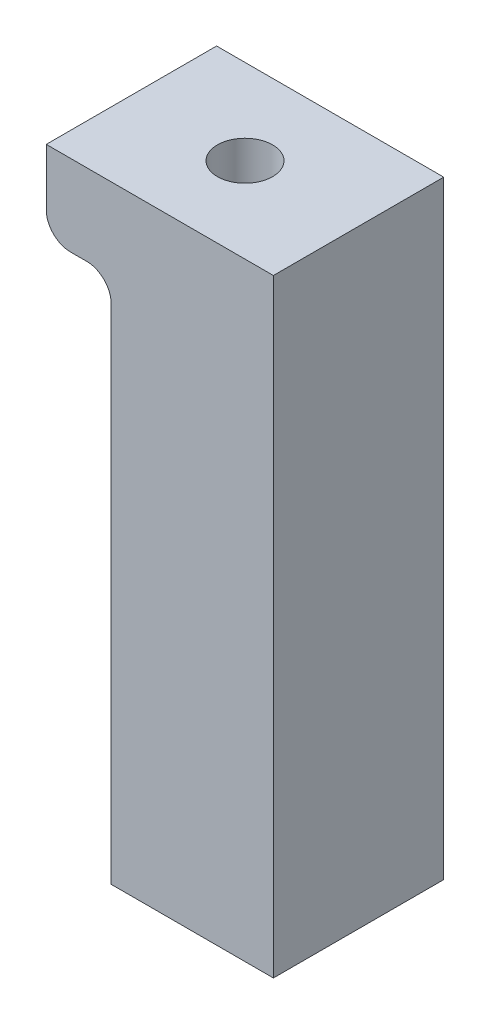
ISO-10303-21;
HEADER;
FILE_DESCRIPTION(('STEP AP214'),'2;1');
FILE_NAME('part.step','',(''),(''),'','','');
FILE_SCHEMA(('AUTOMOTIVE_DESIGN { 1 0 10303 214 1 1 1 1 }'));
ENDSEC;
DATA;
#1=APPLICATION_CONTEXT('core data for automotive mechanical design processes');
#2=APPLICATION_PROTOCOL_DEFINITION('international standard','automotive_design',2000,#1);
#3=PRODUCT_CONTEXT('',#1,'mechanical');
#4=PRODUCT('Part','Part','',(#3));
#5=PRODUCT_RELATED_PRODUCT_CATEGORY('part','',(#4));
#6=PRODUCT_DEFINITION_FORMATION('','',#4);
#7=PRODUCT_DEFINITION_CONTEXT('part definition',#1,'design');
#8=PRODUCT_DEFINITION('design','',#6,#7);
#9=PRODUCT_DEFINITION_SHAPE('','',#8);
#10=(LENGTH_UNIT() NAMED_UNIT(*) SI_UNIT(.MILLI.,.METRE.));
#11=(NAMED_UNIT(*) PLANE_ANGLE_UNIT() SI_UNIT($,.RADIAN.));
#12=(NAMED_UNIT(*) SI_UNIT($,.STERADIAN.) SOLID_ANGLE_UNIT());
#13=UNCERTAINTY_MEASURE_WITH_UNIT(LENGTH_MEASURE(1.E-05),#10,'distance_accuracy_value','');
#14=(GEOMETRIC_REPRESENTATION_CONTEXT(3) GLOBAL_UNCERTAINTY_ASSIGNED_CONTEXT((#13)) GLOBAL_UNIT_ASSIGNED_CONTEXT((#10,
#11,#12)) REPRESENTATION_CONTEXT('',''));
#15=CARTESIAN_POINT('',(0.,0.,0.));
#16=DIRECTION('',(0.,0.,1.));
#17=DIRECTION('',(1.,0.,0.));
#18=AXIS2_PLACEMENT_3D('',#15,#16,#17);
#19=CARTESIAN_POINT('',(14.,110.,-10.5));
#20=DIRECTION('',(-1.,0.,0.));
#21=DIRECTION('',(0.,0.,1.));
#22=AXIS2_PLACEMENT_3D('',#19,#20,#21);
#23=PLANE('',#22);
#24=DIRECTION('',(0.,0.,-1.));
#25=VECTOR('',#24,1.);
#26=CARTESIAN_POINT('',(14.,75.,-10.5));
#27=LINE('',#26,#25);
#28=CARTESIAN_POINT('',(14.,75.,10.5));
#29=VERTEX_POINT('',#28);
#30=CARTESIAN_POINT('',(14.,75.,-10.5));
#31=VERTEX_POINT('',#30);
#32=EDGE_CURVE('E163',#29,#31,#27,.T.);
#33=ORIENTED_EDGE('',*,*,#32,.F.);
#34=DIRECTION('',(0.,-1.,0.));
#35=VECTOR('',#34,1.);
#36=CARTESIAN_POINT('',(14.,110.,10.5));
#37=LINE('',#36,#35);
#38=CARTESIAN_POINT('',(14.,0.,10.5));
#39=VERTEX_POINT('',#38);
#40=EDGE_CURVE('E143',#29,#39,#37,.T.);
#41=ORIENTED_EDGE('',*,*,#40,.T.);
#42=DIRECTION('',(0.,0.,-1.));
#43=VECTOR('',#42,1.);
#44=CARTESIAN_POINT('',(14.,0.,-10.5));
#45=LINE('',#44,#43);
#46=CARTESIAN_POINT('',(14.,0.,-10.5));
#47=VERTEX_POINT('',#46);
#48=EDGE_CURVE('E153',#39,#47,#45,.T.);
#49=ORIENTED_EDGE('',*,*,#48,.T.);
#50=DIRECTION('',(0.,-1.,0.));
#51=VECTOR('',#50,1.);
#52=CARTESIAN_POINT('',(14.,110.,-10.5));
#53=LINE('',#52,#51);
#54=EDGE_CURVE('E152',#31,#47,#53,.T.);
#55=ORIENTED_EDGE('',*,*,#54,.F.);
#56=EDGE_LOOP('',(#33,#41,#49,#55));
#57=FACE_BOUND('',#56,.T.);
#58=ADVANCED_FACE('F39',(#57),#23,.F.);
#59=CARTESIAN_POINT('',(-14.,110.,-10.5));
#60=DIRECTION('',(0.,0.,1.));
#61=DIRECTION('',(1.,0.,0.));
#62=AXIS2_PLACEMENT_3D('',#59,#60,#61);
#63=PLANE('',#62);
#64=DIRECTION('',(-1.,0.,0.));
#65=VECTOR('',#64,1.);
#66=CARTESIAN_POINT('',(-14.,65.,-10.5));
#67=LINE('',#66,#65);
#68=CARTESIAN_POINT('',(-9.,65.,-10.5));
#69=VERTEX_POINT('',#68);
#70=CARTESIAN_POINT('',(-11.,65.,-10.5));
#71=VERTEX_POINT('',#70);
#72=EDGE_CURVE('E131',#69,#71,#67,.T.);
#73=ORIENTED_EDGE('',*,*,#72,.T.);
#74=CARTESIAN_POINT('',(-11.,68.,-10.5));
#75=DIRECTION('',(0.,0.,1.));
#76=DIRECTION('',(1.,0.,0.));
#77=AXIS2_PLACEMENT_3D('',#74,#75,#76);
#78=CIRCLE('',#77,3.);
#79=CARTESIAN_POINT('',(-14.,68.,-10.5));
#80=VERTEX_POINT('',#79);
#81=EDGE_CURVE('E62',#71,#80,#78,.F.);
#82=ORIENTED_EDGE('',*,*,#81,.T.);
#83=DIRECTION('',(0.,-1.,0.));
#84=VECTOR('',#83,1.);
#85=CARTESIAN_POINT('',(-14.,110.,-10.5));
#86=LINE('',#85,#84);
#87=CARTESIAN_POINT('',(-14.,75.,-10.5));
#88=VERTEX_POINT('',#87);
#89=EDGE_CURVE('E151',#88,#80,#86,.T.);
#90=ORIENTED_EDGE('',*,*,#89,.F.);
#91=DIRECTION('',(-1.,0.,0.));
#92=VECTOR('',#91,1.);
#93=CARTESIAN_POINT('',(-14.,75.,-10.5));
#94=LINE('',#93,#92);
#95=EDGE_CURVE('E160',#31,#88,#94,.T.);
#96=ORIENTED_EDGE('',*,*,#95,.F.);
#97=ORIENTED_EDGE('',*,*,#54,.T.);
#98=DIRECTION('',(-1.,0.,0.));
#99=VECTOR('',#98,1.);
#100=CARTESIAN_POINT('',(-14.,0.,-10.5));
#101=LINE('',#100,#99);
#102=CARTESIAN_POINT('',(-6.,0.,-10.5));
#103=VERTEX_POINT('',#102);
#104=EDGE_CURVE('E148',#47,#103,#101,.T.);
#105=ORIENTED_EDGE('',*,*,#104,.T.);
#106=DIRECTION('',(0.,1.,0.));
#107=VECTOR('',#106,1.);
#108=CARTESIAN_POINT('',(-6.,0.,-10.5));
#109=LINE('',#108,#107);
#110=CARTESIAN_POINT('',(-6.,62.,-10.5));
#111=VERTEX_POINT('',#110);
#112=EDGE_CURVE('E128',#103,#111,#109,.T.);
#113=ORIENTED_EDGE('',*,*,#112,.T.);
#114=CARTESIAN_POINT('',(-9.,62.,-10.5));
#115=DIRECTION('',(0.,0.,1.));
#116=DIRECTION('',(1.,0.,0.));
#117=AXIS2_PLACEMENT_3D('',#114,#115,#116);
#118=CIRCLE('',#117,3.);
#119=EDGE_CURVE('E11',#111,#69,#118,.T.);
#120=ORIENTED_EDGE('',*,*,#119,.T.);
#121=EDGE_LOOP('',(#73,#82,#90,#96,#97,#105,#113,#120));
#122=FACE_BOUND('',#121,.T.);
#123=ADVANCED_FACE('F197',(#122),#63,.F.);
#124=CARTESIAN_POINT('',(-14.,110.,-10.5));
#125=DIRECTION('',(1.,0.,0.));
#126=DIRECTION('',(0.,0.,-1.));
#127=AXIS2_PLACEMENT_3D('',#124,#125,#126);
#128=PLANE('',#127);
#129=ORIENTED_EDGE('',*,*,#89,.T.);
#130=DIRECTION('',(0.,0.,1.));
#131=VECTOR('',#130,1.);
#132=CARTESIAN_POINT('',(-14.,68.,-10.5));
#133=LINE('',#132,#131);
#134=CARTESIAN_POINT('',(-14.,68.,10.5));
#135=VERTEX_POINT('',#134);
#136=EDGE_CURVE('E180',#80,#135,#133,.T.);
#137=ORIENTED_EDGE('',*,*,#136,.T.);
#138=DIRECTION('',(0.,-1.,0.));
#139=VECTOR('',#138,1.);
#140=CARTESIAN_POINT('',(-14.,110.,10.5));
#141=LINE('',#140,#139);
#142=CARTESIAN_POINT('',(-14.,75.,10.5));
#143=VERTEX_POINT('',#142);
#144=EDGE_CURVE('E147',#143,#135,#141,.T.);
#145=ORIENTED_EDGE('',*,*,#144,.F.);
#146=DIRECTION('',(0.,0.,1.));
#147=VECTOR('',#146,1.);
#148=CARTESIAN_POINT('',(-14.,75.,-10.5));
#149=LINE('',#148,#147);
#150=EDGE_CURVE('E156',#88,#143,#149,.T.);
#151=ORIENTED_EDGE('',*,*,#150,.F.);
#152=EDGE_LOOP('',(#129,#137,#145,#151));
#153=FACE_BOUND('',#152,.T.);
#154=ADVANCED_FACE('F201',(#153),#128,.F.);
#155=CARTESIAN_POINT('',(-14.,110.,10.5));
#156=DIRECTION('',(0.,0.,-1.));
#157=DIRECTION('',(-1.,0.,0.));
#158=AXIS2_PLACEMENT_3D('',#155,#156,#157);
#159=PLANE('',#158);
#160=ORIENTED_EDGE('',*,*,#144,.T.);
#161=CARTESIAN_POINT('',(-11.,68.,10.5));
#162=DIRECTION('',(0.,0.,-1.));
#163=DIRECTION('',(-1.,0.,0.));
#164=AXIS2_PLACEMENT_3D('',#161,#162,#163);
#165=CIRCLE('',#164,3.);
#166=CARTESIAN_POINT('',(-11.,65.,10.5));
#167=VERTEX_POINT('',#166);
#168=EDGE_CURVE('E54',#135,#167,#165,.F.);
#169=ORIENTED_EDGE('',*,*,#168,.T.);
#170=DIRECTION('',(-1.,0.,0.));
#171=VECTOR('',#170,1.);
#172=CARTESIAN_POINT('',(-14.,65.,10.5));
#173=LINE('',#172,#171);
#174=CARTESIAN_POINT('',(-9.,65.,10.5));
#175=VERTEX_POINT('',#174);
#176=EDGE_CURVE('E123',#175,#167,#173,.T.);
#177=ORIENTED_EDGE('',*,*,#176,.F.);
#178=CARTESIAN_POINT('',(-9.,62.,10.5));
#179=DIRECTION('',(0.,0.,-1.));
#180=DIRECTION('',(-1.,0.,0.));
#181=AXIS2_PLACEMENT_3D('',#178,#179,#180);
#182=CIRCLE('',#181,3.);
#183=CARTESIAN_POINT('',(-6.,62.,10.5));
#184=VERTEX_POINT('',#183);
#185=EDGE_CURVE('E47',#175,#184,#182,.T.);
#186=ORIENTED_EDGE('',*,*,#185,.T.);
#187=DIRECTION('',(0.,1.,0.));
#188=VECTOR('',#187,1.);
#189=CARTESIAN_POINT('',(-6.,0.,10.5));
#190=LINE('',#189,#188);
#191=CARTESIAN_POINT('',(-6.,0.,10.5));
#192=VERTEX_POINT('',#191);
#193=EDGE_CURVE('E119',#192,#184,#190,.T.);
#194=ORIENTED_EDGE('',*,*,#193,.F.);
#195=DIRECTION('',(1.,0.,0.));
#196=VECTOR('',#195,1.);
#197=CARTESIAN_POINT('',(-14.,0.,10.5));
#198=LINE('',#197,#196);
#199=EDGE_CURVE('E144',#192,#39,#198,.T.);
#200=ORIENTED_EDGE('',*,*,#199,.T.);
#201=ORIENTED_EDGE('',*,*,#40,.F.);
#202=DIRECTION('',(1.,0.,0.));
#203=VECTOR('',#202,1.);
#204=CARTESIAN_POINT('',(-14.,75.,10.5));
#205=LINE('',#204,#203);
#206=EDGE_CURVE('E146',#143,#29,#205,.T.);
#207=ORIENTED_EDGE('',*,*,#206,.F.);
#208=EDGE_LOOP('',(#160,#169,#177,#186,#194,#200,#201,#207));
#209=FACE_BOUND('',#208,.T.);
#210=ADVANCED_FACE('F186',(#209),#159,.F.);
#211=CARTESIAN_POINT('',(0.,0.,0.));
#212=DIRECTION('',(0.,1.,0.));
#213=DIRECTION('',(0.,0.,1.));
#214=AXIS2_PLACEMENT_3D('',#211,#212,#213);
#215=PLANE('',#214);
#216=CARTESIAN_POINT('',(0.,0.,0.));
#217=DIRECTION('',(0.,-1.,0.));
#218=DIRECTION('',(0.,0.,-1.));
#219=AXIS2_PLACEMENT_3D('',#216,#217,#218);
#220=CIRCLE('',#219,2.49999999999999);
#221=CARTESIAN_POINT('',(0.,0.,-2.49999999999999));
#222=VERTEX_POINT('',#221);
#223=EDGE_CURVE('E120',#222,#222,#220,.T.);
#224=ORIENTED_EDGE('',*,*,#223,.F.);
#225=EDGE_LOOP('',(#224));
#226=FACE_BOUND('',#225,.T.);
#227=ORIENTED_EDGE('',*,*,#199,.F.);
#228=DIRECTION('',(0.,0.,1.));
#229=VECTOR('',#228,1.);
#230=CARTESIAN_POINT('',(-6.,0.,-10.5));
#231=LINE('',#230,#229);
#232=EDGE_CURVE('E132',#103,#192,#231,.T.);
#233=ORIENTED_EDGE('',*,*,#232,.F.);
#234=ORIENTED_EDGE('',*,*,#104,.F.);
#235=ORIENTED_EDGE('',*,*,#48,.F.);
#236=EDGE_LOOP('',(#227,#233,#234,#235));
#237=FACE_BOUND('',#236,.T.);
#238=ADVANCED_FACE('F211',(#226,#237),#215,.F.);
#239=CARTESIAN_POINT('',(-14.,75.,-10.5));
#240=DIRECTION('',(0.,1.,0.));
#241=DIRECTION('',(-1.,0.,0.));
#242=AXIS2_PLACEMENT_3D('',#239,#240,#241);
#243=PLANE('',#242);
#244=CARTESIAN_POINT('',(0.,75.,0.));
#245=DIRECTION('',(0.,1.,0.));
#246=DIRECTION('',(0.,0.,1.));
#247=AXIS2_PLACEMENT_3D('',#244,#245,#246);
#248=CIRCLE('',#247,3.39999999999999);
#249=CARTESIAN_POINT('',(0.,75.,3.39999999999999));
#250=VERTEX_POINT('',#249);
#251=EDGE_CURVE('E137',#250,#250,#248,.T.);
#252=ORIENTED_EDGE('',*,*,#251,.F.);
#253=EDGE_LOOP('',(#252));
#254=FACE_BOUND('',#253,.T.);
#255=ORIENTED_EDGE('',*,*,#206,.T.);
#256=ORIENTED_EDGE('',*,*,#32,.T.);
#257=ORIENTED_EDGE('',*,*,#95,.T.);
#258=ORIENTED_EDGE('',*,*,#150,.T.);
#259=EDGE_LOOP('',(#255,#256,#257,#258));
#260=FACE_BOUND('',#259,.T.);
#261=ADVANCED_FACE('F205',(#254,#260),#243,.T.);
#262=CARTESIAN_POINT('',(0.,55.25,0.));
#263=DIRECTION('',(0.,1.,0.));
#264=DIRECTION('',(0.,0.,1.));
#265=AXIS2_PLACEMENT_3D('',#262,#263,#264);
#266=CONICAL_SURFACE('',#265,3.39999999999999,1.02974425867665);
#267=CARTESIAN_POINT('',(0.,53.2070738953063,0.));
#268=VERTEX_POINT('',#267);
#269=VERTEX_LOOP('',#268);
#270=FACE_BOUND('',#269,.T.);
#271=CARTESIAN_POINT('',(0.,55.25,0.));
#272=DIRECTION('',(0.,1.,0.));
#273=DIRECTION('',(0.,0.,1.));
#274=AXIS2_PLACEMENT_3D('',#271,#272,#273);
#275=CIRCLE('',#274,3.39999999999999);
#276=CARTESIAN_POINT('',(0.,55.25,3.39999999999999));
#277=VERTEX_POINT('',#276);
#278=EDGE_CURVE('E140',#277,#277,#275,.T.);
#279=ORIENTED_EDGE('',*,*,#278,.T.);
#280=EDGE_LOOP('',(#279));
#281=FACE_BOUND('',#280,.T.);
#282=ADVANCED_FACE('F219',(#270,#281),#266,.F.);
#283=CARTESIAN_POINT('',(0.,75.,0.));
#284=DIRECTION('',(0.,1.,0.));
#285=DIRECTION('',(0.,0.,1.));
#286=AXIS2_PLACEMENT_3D('',#283,#284,#285);
#287=CYLINDRICAL_SURFACE('',#286,3.39999999999999);
#288=ORIENTED_EDGE('',*,*,#278,.F.);
#289=EDGE_LOOP('',(#288));
#290=FACE_BOUND('',#289,.T.);
#291=ORIENTED_EDGE('',*,*,#251,.T.);
#292=EDGE_LOOP('',(#291));
#293=FACE_BOUND('',#292,.T.);
#294=ADVANCED_FACE('F241',(#290,#293),#287,.F.);
#295=CARTESIAN_POINT('',(-14.,65.,-10.5));
#296=DIRECTION('',(0.,1.,0.));
#297=DIRECTION('',(0.,0.,1.));
#298=AXIS2_PLACEMENT_3D('',#295,#296,#297);
#299=PLANE('',#298);
#300=ORIENTED_EDGE('',*,*,#72,.F.);
#301=DIRECTION('',(0.,0.,1.));
#302=VECTOR('',#301,1.);
#303=CARTESIAN_POINT('',(-9.,65.,10.5));
#304=LINE('',#303,#302);
#305=EDGE_CURVE('E175',#69,#175,#304,.T.);
#306=ORIENTED_EDGE('',*,*,#305,.T.);
#307=ORIENTED_EDGE('',*,*,#176,.T.);
#308=DIRECTION('',(0.,0.,1.));
#309=VECTOR('',#308,1.);
#310=CARTESIAN_POINT('',(-11.,65.,-10.5));
#311=LINE('',#310,#309);
#312=EDGE_CURVE('E159',#167,#71,#311,.F.);
#313=ORIENTED_EDGE('',*,*,#312,.T.);
#314=EDGE_LOOP('',(#300,#306,#307,#313));
#315=FACE_BOUND('',#314,.T.);
#316=ADVANCED_FACE('F199',(#315),#299,.F.);
#317=CARTESIAN_POINT('',(-6.,0.,-10.5));
#318=DIRECTION('',(1.,0.,0.));
#319=DIRECTION('',(0.,0.,-1.));
#320=AXIS2_PLACEMENT_3D('',#317,#318,#319);
#321=PLANE('',#320);
#322=ORIENTED_EDGE('',*,*,#193,.T.);
#323=DIRECTION('',(0.,0.,1.));
#324=VECTOR('',#323,1.);
#325=CARTESIAN_POINT('',(-6.,62.,-10.5));
#326=LINE('',#325,#324);
#327=EDGE_CURVE('E178',#184,#111,#326,.F.);
#328=ORIENTED_EDGE('',*,*,#327,.T.);
#329=ORIENTED_EDGE('',*,*,#112,.F.);
#330=ORIENTED_EDGE('',*,*,#232,.T.);
#331=EDGE_LOOP('',(#322,#328,#329,#330));
#332=FACE_BOUND('',#331,.T.);
#333=ADVANCED_FACE('F192',(#332),#321,.F.);
#334=CARTESIAN_POINT('',(-9.,62.,-10.5));
#335=DIRECTION('',(0.,0.,-1.));
#336=DIRECTION('',(-1.,0.,0.));
#337=AXIS2_PLACEMENT_3D('',#334,#335,#336);
#338=CYLINDRICAL_SURFACE('',#337,3.);
#339=ORIENTED_EDGE('',*,*,#119,.F.);
#340=ORIENTED_EDGE('',*,*,#327,.F.);
#341=ORIENTED_EDGE('',*,*,#185,.F.);
#342=ORIENTED_EDGE('',*,*,#305,.F.);
#343=EDGE_LOOP('',(#339,#340,#341,#342));
#344=FACE_BOUND('',#343,.T.);
#345=ADVANCED_FACE('F195',(#344),#338,.F.);
#346=CARTESIAN_POINT('',(-11.,68.,-10.5));
#347=DIRECTION('',(0.,0.,1.));
#348=DIRECTION('',(1.,0.,0.));
#349=AXIS2_PLACEMENT_3D('',#346,#347,#348);
#350=CYLINDRICAL_SURFACE('',#349,3.);
#351=ORIENTED_EDGE('',*,*,#81,.F.);
#352=ORIENTED_EDGE('',*,*,#312,.F.);
#353=ORIENTED_EDGE('',*,*,#168,.F.);
#354=ORIENTED_EDGE('',*,*,#136,.F.);
#355=EDGE_LOOP('',(#351,#352,#353,#354));
#356=FACE_BOUND('',#355,.T.);
#357=ADVANCED_FACE('F41',(#356),#350,.T.);
#358=CARTESIAN_POINT('',(0.,19.75,0.));
#359=DIRECTION('',(0.,-1.,0.));
#360=DIRECTION('',(0.,0.,-1.));
#361=AXIS2_PLACEMENT_3D('',#358,#359,#360);
#362=CONICAL_SURFACE('',#361,2.49999999999999,1.02974425867665);
#363=CARTESIAN_POINT('',(0.,21.2521515475689,0.));
#364=VERTEX_POINT('',#363);
#365=VERTEX_LOOP('',#364);
#366=FACE_BOUND('',#365,.T.);
#367=CARTESIAN_POINT('',(0.,19.75,0.));
#368=DIRECTION('',(0.,-1.,0.));
#369=DIRECTION('',(0.,0.,-1.));
#370=AXIS2_PLACEMENT_3D('',#367,#368,#369);
#371=CIRCLE('',#370,2.49999999999999);
#372=CARTESIAN_POINT('',(0.,19.75,-2.49999999999999));
#373=VERTEX_POINT('',#372);
#374=EDGE_CURVE('E117',#373,#373,#371,.T.);
#375=ORIENTED_EDGE('',*,*,#374,.T.);
#376=EDGE_LOOP('',(#375));
#377=FACE_BOUND('',#376,.T.);
#378=ADVANCED_FACE('F110',(#366,#377),#362,.F.);
#379=CARTESIAN_POINT('',(0.,0.,0.));
#380=DIRECTION('',(0.,-1.,0.));
#381=DIRECTION('',(0.,0.,-1.));
#382=AXIS2_PLACEMENT_3D('',#379,#380,#381);
#383=CYLINDRICAL_SURFACE('',#382,2.49999999999999);
#384=ORIENTED_EDGE('',*,*,#374,.F.);
#385=EDGE_LOOP('',(#384));
#386=FACE_BOUND('',#385,.T.);
#387=ORIENTED_EDGE('',*,*,#223,.T.);
#388=EDGE_LOOP('',(#387));
#389=FACE_BOUND('',#388,.T.);
#390=ADVANCED_FACE('F113',(#386,#389),#383,.F.);
#391=CLOSED_SHELL('',(#58,#123,#154,#210,#238,#261,#282,#294,#316,#333,#345,#357,#378,#390));
#392=MANIFOLD_SOLID_BREP('B2',#391);
#393=ADVANCED_BREP_SHAPE_REPRESENTATION('',(#18,#392),#14);
#394=SHAPE_DEFINITION_REPRESENTATION(#9,#393);
ENDSEC;
END-ISO-10303-21;
